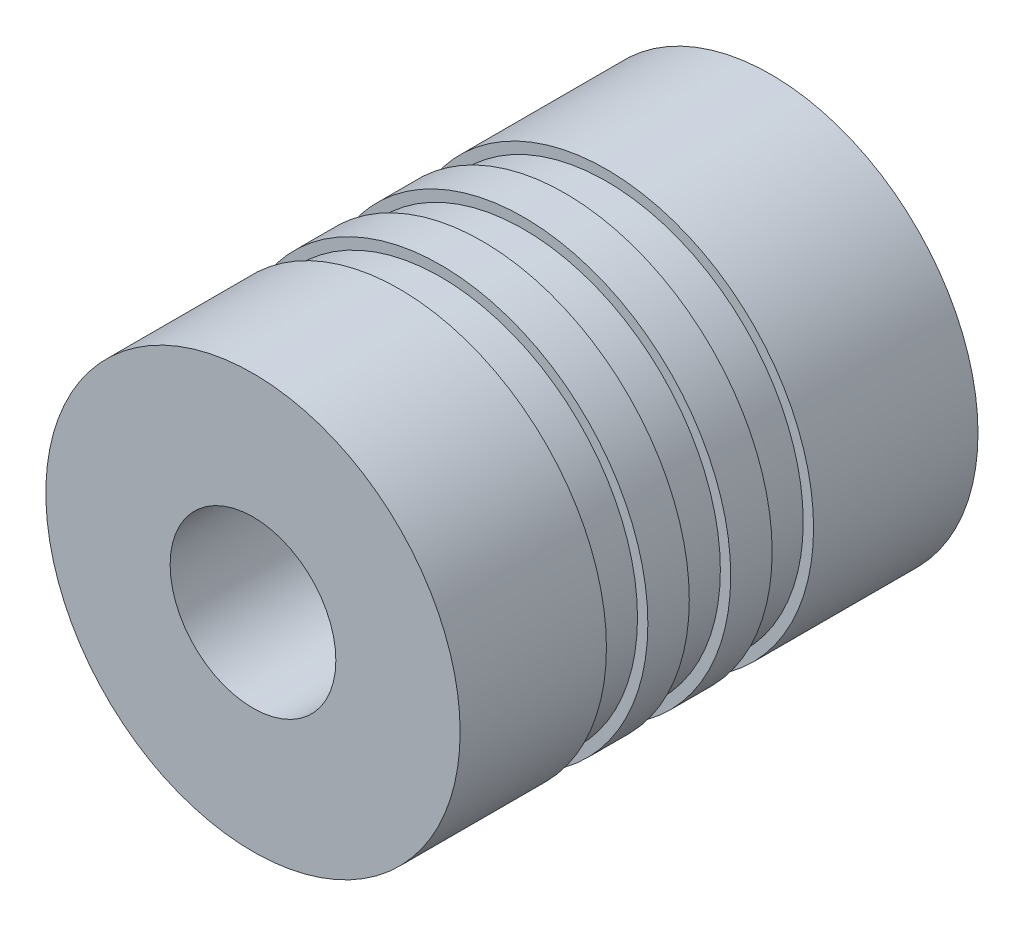
ISO-10303-21;
HEADER;
FILE_DESCRIPTION(('STEP AP214'),'2;1');
FILE_NAME('part.step','',(''),(''),'','','');
FILE_SCHEMA(('AUTOMOTIVE_DESIGN { 1 0 10303 214 1 1 1 1 }'));
ENDSEC;
DATA;
#1=APPLICATION_CONTEXT('core data for automotive mechanical design processes');
#2=APPLICATION_PROTOCOL_DEFINITION('international standard','automotive_design',2000,#1);
#3=PRODUCT_CONTEXT('',#1,'mechanical');
#4=PRODUCT('Part','Part','',(#3));
#5=PRODUCT_RELATED_PRODUCT_CATEGORY('part','',(#4));
#6=PRODUCT_DEFINITION_FORMATION('','',#4);
#7=PRODUCT_DEFINITION_CONTEXT('part definition',#1,'design');
#8=PRODUCT_DEFINITION('design','',#6,#7);
#9=PRODUCT_DEFINITION_SHAPE('','',#8);
#10=(LENGTH_UNIT() NAMED_UNIT(*) SI_UNIT(.MILLI.,.METRE.));
#11=(NAMED_UNIT(*) PLANE_ANGLE_UNIT() SI_UNIT($,.RADIAN.));
#12=(NAMED_UNIT(*) SI_UNIT($,.STERADIAN.) SOLID_ANGLE_UNIT());
#13=UNCERTAINTY_MEASURE_WITH_UNIT(LENGTH_MEASURE(1.E-05),#10,'distance_accuracy_value','');
#14=(GEOMETRIC_REPRESENTATION_CONTEXT(3) GLOBAL_UNCERTAINTY_ASSIGNED_CONTEXT((#13)) GLOBAL_UNIT_ASSIGNED_CONTEXT((#10,
#11,#12)) REPRESENTATION_CONTEXT('',''));
#15=CARTESIAN_POINT('',(0.,0.,0.));
#16=DIRECTION('',(0.,0.,1.));
#17=DIRECTION('',(1.,0.,0.));
#18=AXIS2_PLACEMENT_3D('',#15,#16,#17);
#19=CARTESIAN_POINT('',(0.,0.,15.9375));
#20=DIRECTION('',(0.,0.,1.));
#21=DIRECTION('',(1.,0.,0.));
#22=AXIS2_PLACEMENT_3D('',#19,#20,#21);
#23=PLANE('',#22);
#24=CARTESIAN_POINT('',(0.,0.,15.9375));
#25=DIRECTION('',(0.,0.,1.));
#26=DIRECTION('',(1.,0.,0.));
#27=AXIS2_PLACEMENT_3D('',#24,#25,#26);
#28=CIRCLE('',#27,9.5);
#29=CARTESIAN_POINT('',(9.5,0.,15.9375));
#30=VERTEX_POINT('',#29);
#31=EDGE_CURVE('E69',#30,#30,#28,.T.);
#32=ORIENTED_EDGE('',*,*,#31,.F.);
#33=EDGE_LOOP('',(#32));
#34=FACE_BOUND('',#33,.T.);
#35=CARTESIAN_POINT('',(0.,0.,15.9375));
#36=DIRECTION('',(0.,0.,1.));
#37=DIRECTION('',(1.,0.,0.));
#38=AXIS2_PLACEMENT_3D('',#35,#36,#37);
#39=CIRCLE('',#38,10.);
#40=CARTESIAN_POINT('',(10.,0.,15.9375));
#41=VERTEX_POINT('',#40);
#42=EDGE_CURVE('E17',#41,#41,#39,.F.);
#43=ORIENTED_EDGE('',*,*,#42,.F.);
#44=EDGE_LOOP('',(#43));
#45=FACE_BOUND('',#44,.T.);
#46=ADVANCED_FACE('F14',(#34,#45),#23,.T.);
#47=CARTESIAN_POINT('',(0.,0.,0.));
#48=DIRECTION('',(0.,0.,1.));
#49=DIRECTION('',(1.,0.,0.));
#50=AXIS2_PLACEMENT_3D('',#47,#48,#49);
#51=CYLINDRICAL_SURFACE('',#50,10.);
#52=ORIENTED_EDGE('',*,*,#42,.T.);
#53=EDGE_LOOP('',(#52));
#54=FACE_BOUND('',#53,.T.);
#55=CARTESIAN_POINT('',(0.,0.,13.9375));
#56=DIRECTION('',(0.,0.,1.));
#57=DIRECTION('',(1.,0.,0.));
#58=AXIS2_PLACEMENT_3D('',#55,#56,#57);
#59=CIRCLE('',#58,10.);
#60=CARTESIAN_POINT('',(10.,0.,13.9375));
#61=VERTEX_POINT('',#60);
#62=EDGE_CURVE('E67',#61,#61,#59,.T.);
#63=ORIENTED_EDGE('',*,*,#62,.T.);
#64=EDGE_LOOP('',(#63));
#65=FACE_BOUND('',#64,.T.);
#66=ADVANCED_FACE('F76',(#54,#65),#51,.T.);
#67=CARTESIAN_POINT('',(0.,0.,15.9375));
#68=DIRECTION('',(0.,0.,1.));
#69=DIRECTION('',(1.,0.,0.));
#70=AXIS2_PLACEMENT_3D('',#67,#68,#69);
#71=CYLINDRICAL_SURFACE('',#70,9.5);
#72=ORIENTED_EDGE('',*,*,#31,.T.);
#73=EDGE_LOOP('',(#72));
#74=FACE_BOUND('',#73,.T.);
#75=CARTESIAN_POINT('',(0.,0.,17.9375));
#76=DIRECTION('',(0.,0.,1.));
#77=DIRECTION('',(1.,0.,0.));
#78=AXIS2_PLACEMENT_3D('',#75,#76,#77);
#79=CIRCLE('',#78,9.5);
#80=CARTESIAN_POINT('',(9.5,0.,17.9375));
#81=VERTEX_POINT('',#80);
#82=EDGE_CURVE('E64',#81,#81,#79,.F.);
#83=ORIENTED_EDGE('',*,*,#82,.T.);
#84=EDGE_LOOP('',(#83));
#85=FACE_BOUND('',#84,.T.);
#86=ADVANCED_FACE('F85',(#74,#85),#71,.T.);
#87=CARTESIAN_POINT('',(0.,0.,13.9375));
#88=DIRECTION('',(0.,0.,1.));
#89=DIRECTION('',(1.,0.,0.));
#90=AXIS2_PLACEMENT_3D('',#87,#88,#89);
#91=PLANE('',#90);
#92=CARTESIAN_POINT('',(0.,0.,13.9375));
#93=DIRECTION('',(0.,0.,1.));
#94=DIRECTION('',(1.,0.,0.));
#95=AXIS2_PLACEMENT_3D('',#92,#93,#94);
#96=CIRCLE('',#95,9.5);
#97=CARTESIAN_POINT('',(9.5,0.,13.9375));
#98=VERTEX_POINT('',#97);
#99=EDGE_CURVE('E61',#98,#98,#96,.F.);
#100=ORIENTED_EDGE('',*,*,#99,.F.);
#101=EDGE_LOOP('',(#100));
#102=FACE_BOUND('',#101,.T.);
#103=ORIENTED_EDGE('',*,*,#62,.F.);
#104=EDGE_LOOP('',(#103));
#105=FACE_BOUND('',#104,.T.);
#106=ADVANCED_FACE('F144',(#102,#105),#91,.F.);
#107=CARTESIAN_POINT('',(0.,0.,17.9375));
#108=DIRECTION('',(0.,0.,1.));
#109=DIRECTION('',(1.,0.,0.));
#110=AXIS2_PLACEMENT_3D('',#107,#108,#109);
#111=PLANE('',#110);
#112=ORIENTED_EDGE('',*,*,#82,.F.);
#113=EDGE_LOOP('',(#112));
#114=FACE_BOUND('',#113,.T.);
#115=CARTESIAN_POINT('',(0.,0.,17.9375));
#116=DIRECTION('',(0.,0.,1.));
#117=DIRECTION('',(1.,0.,0.));
#118=AXIS2_PLACEMENT_3D('',#115,#116,#117);
#119=CIRCLE('',#118,10.);
#120=CARTESIAN_POINT('',(10.,0.,17.9375));
#121=VERTEX_POINT('',#120);
#122=EDGE_CURVE('E58',#121,#121,#119,.T.);
#123=ORIENTED_EDGE('',*,*,#122,.F.);
#124=EDGE_LOOP('',(#123));
#125=FACE_BOUND('',#124,.T.);
#126=ADVANCED_FACE('F140',(#114,#125),#111,.F.);
#127=CARTESIAN_POINT('',(0.,0.,11.9375));
#128=DIRECTION('',(0.,0.,1.));
#129=DIRECTION('',(1.,0.,0.));
#130=AXIS2_PLACEMENT_3D('',#127,#128,#129);
#131=CYLINDRICAL_SURFACE('',#130,9.5);
#132=CARTESIAN_POINT('',(0.,0.,11.9375));
#133=DIRECTION('',(0.,0.,1.));
#134=DIRECTION('',(1.,0.,0.));
#135=AXIS2_PLACEMENT_3D('',#132,#133,#134);
#136=CIRCLE('',#135,9.5);
#137=CARTESIAN_POINT('',(9.5,0.,11.9375));
#138=VERTEX_POINT('',#137);
#139=EDGE_CURVE('E55',#138,#138,#136,.F.);
#140=ORIENTED_EDGE('',*,*,#139,.F.);
#141=EDGE_LOOP('',(#140));
#142=FACE_BOUND('',#141,.T.);
#143=ORIENTED_EDGE('',*,*,#99,.T.);
#144=EDGE_LOOP('',(#143));
#145=FACE_BOUND('',#144,.T.);
#146=ADVANCED_FACE('F136',(#142,#145),#131,.T.);
#147=CARTESIAN_POINT('',(0.,0.,0.));
#148=DIRECTION('',(0.,0.,1.));
#149=DIRECTION('',(1.,0.,0.));
#150=AXIS2_PLACEMENT_3D('',#147,#148,#149);
#151=CYLINDRICAL_SURFACE('',#150,10.);
#152=ORIENTED_EDGE('',*,*,#122,.T.);
#153=EDGE_LOOP('',(#152));
#154=FACE_BOUND('',#153,.T.);
#155=CARTESIAN_POINT('',(0.,0.,25.));
#156=DIRECTION('',(0.,0.,1.));
#157=DIRECTION('',(1.,0.,0.));
#158=AXIS2_PLACEMENT_3D('',#155,#156,#157);
#159=CIRCLE('',#158,10.);
#160=CARTESIAN_POINT('',(10.,0.,25.));
#161=VERTEX_POINT('',#160);
#162=EDGE_CURVE('E52',#161,#161,#159,.F.);
#163=ORIENTED_EDGE('',*,*,#162,.T.);
#164=EDGE_LOOP('',(#163));
#165=FACE_BOUND('',#164,.T.);
#166=ADVANCED_FACE('F132',(#154,#165),#151,.T.);
#167=CARTESIAN_POINT('',(0.,0.,11.9375));
#168=DIRECTION('',(0.,0.,1.));
#169=DIRECTION('',(1.,0.,0.));
#170=AXIS2_PLACEMENT_3D('',#167,#168,#169);
#171=PLANE('',#170);
#172=ORIENTED_EDGE('',*,*,#139,.T.);
#173=EDGE_LOOP('',(#172));
#174=FACE_BOUND('',#173,.T.);
#175=CARTESIAN_POINT('',(0.,0.,11.9375));
#176=DIRECTION('',(0.,0.,1.));
#177=DIRECTION('',(1.,0.,0.));
#178=AXIS2_PLACEMENT_3D('',#175,#176,#177);
#179=CIRCLE('',#178,10.);
#180=CARTESIAN_POINT('',(10.,0.,11.9375));
#181=VERTEX_POINT('',#180);
#182=EDGE_CURVE('E49',#181,#181,#179,.F.);
#183=ORIENTED_EDGE('',*,*,#182,.F.);
#184=EDGE_LOOP('',(#183));
#185=FACE_BOUND('',#184,.T.);
#186=ADVANCED_FACE('F128',(#174,#185),#171,.T.);
#187=CARTESIAN_POINT('',(0.,0.,25.));
#188=DIRECTION('',(0.,0.,-1.));
#189=DIRECTION('',(-1.,0.,0.));
#190=AXIS2_PLACEMENT_3D('',#187,#188,#189);
#191=PLANE('',#190);
#192=ORIENTED_EDGE('',*,*,#162,.F.);
#193=EDGE_LOOP('',(#192));
#194=FACE_BOUND('',#193,.T.);
#195=CARTESIAN_POINT('',(0.,0.,25.));
#196=DIRECTION('',(0.,0.,-1.));
#197=DIRECTION('',(-1.,0.,0.));
#198=AXIS2_PLACEMENT_3D('',#195,#196,#197);
#199=CIRCLE('',#198,4.);
#200=CARTESIAN_POINT('',(-4.,0.,25.));
#201=VERTEX_POINT('',#200);
#202=EDGE_CURVE('E46',#201,#201,#199,.T.);
#203=ORIENTED_EDGE('',*,*,#202,.T.);
#204=EDGE_LOOP('',(#203));
#205=FACE_BOUND('',#204,.T.);
#206=ADVANCED_FACE('F124',(#194,#205),#191,.F.);
#207=CARTESIAN_POINT('',(0.,0.,0.));
#208=DIRECTION('',(0.,0.,1.));
#209=DIRECTION('',(1.,0.,0.));
#210=AXIS2_PLACEMENT_3D('',#207,#208,#209);
#211=CYLINDRICAL_SURFACE('',#210,10.);
#212=CARTESIAN_POINT('',(0.,0.,9.9375));
#213=DIRECTION('',(0.,0.,1.));
#214=DIRECTION('',(1.,0.,0.));
#215=AXIS2_PLACEMENT_3D('',#212,#213,#214);
#216=CIRCLE('',#215,10.);
#217=CARTESIAN_POINT('',(10.,0.,9.9375));
#218=VERTEX_POINT('',#217);
#219=EDGE_CURVE('E43',#218,#218,#216,.T.);
#220=ORIENTED_EDGE('',*,*,#219,.T.);
#221=EDGE_LOOP('',(#220));
#222=FACE_BOUND('',#221,.T.);
#223=ORIENTED_EDGE('',*,*,#182,.T.);
#224=EDGE_LOOP('',(#223));
#225=FACE_BOUND('',#224,.T.);
#226=ADVANCED_FACE('F120',(#222,#225),#211,.T.);
#227=CARTESIAN_POINT('',(0.,0.,25.));
#228=DIRECTION('',(0.,0.,-1.));
#229=DIRECTION('',(-1.,0.,0.));
#230=AXIS2_PLACEMENT_3D('',#227,#228,#229);
#231=CYLINDRICAL_SURFACE('',#230,4.);
#232=ORIENTED_EDGE('',*,*,#202,.F.);
#233=EDGE_LOOP('',(#232));
#234=FACE_BOUND('',#233,.T.);
#235=CARTESIAN_POINT('',(0.,0.,15.475));
#236=DIRECTION('',(0.,0.,-1.));
#237=DIRECTION('',(-1.,0.,0.));
#238=AXIS2_PLACEMENT_3D('',#235,#236,#237);
#239=CIRCLE('',#238,4.);
#240=CARTESIAN_POINT('',(-4.,0.,15.475));
#241=VERTEX_POINT('',#240);
#242=EDGE_CURVE('E40',#241,#241,#239,.T.);
#243=ORIENTED_EDGE('',*,*,#242,.T.);
#244=EDGE_LOOP('',(#243));
#245=FACE_BOUND('',#244,.T.);
#246=ADVANCED_FACE('F116',(#234,#245),#231,.F.);
#247=CARTESIAN_POINT('',(0.,0.,9.9375));
#248=DIRECTION('',(0.,0.,1.));
#249=DIRECTION('',(1.,0.,0.));
#250=AXIS2_PLACEMENT_3D('',#247,#248,#249);
#251=PLANE('',#250);
#252=CARTESIAN_POINT('',(0.,0.,9.9375));
#253=DIRECTION('',(0.,0.,1.));
#254=DIRECTION('',(1.,0.,0.));
#255=AXIS2_PLACEMENT_3D('',#252,#253,#254);
#256=CIRCLE('',#255,9.5);
#257=CARTESIAN_POINT('',(9.5,0.,9.9375));
#258=VERTEX_POINT('',#257);
#259=EDGE_CURVE('E37',#258,#258,#256,.F.);
#260=ORIENTED_EDGE('',*,*,#259,.F.);
#261=EDGE_LOOP('',(#260));
#262=FACE_BOUND('',#261,.T.);
#263=ORIENTED_EDGE('',*,*,#219,.F.);
#264=EDGE_LOOP('',(#263));
#265=FACE_BOUND('',#264,.T.);
#266=ADVANCED_FACE('F112',(#262,#265),#251,.F.);
#267=CARTESIAN_POINT('',(0.,0.,15.475));
#268=DIRECTION('',(0.,0.,-1.));
#269=DIRECTION('',(-1.,0.,0.));
#270=AXIS2_PLACEMENT_3D('',#267,#268,#269);
#271=PLANE('',#270);
#272=ORIENTED_EDGE('',*,*,#242,.F.);
#273=EDGE_LOOP('',(#272));
#274=FACE_BOUND('',#273,.T.);
#275=CARTESIAN_POINT('',(0.,0.,15.475));
#276=DIRECTION('',(0.,0.,1.));
#277=DIRECTION('',(1.,0.,0.));
#278=AXIS2_PLACEMENT_3D('',#275,#276,#277);
#279=CIRCLE('',#278,2.5);
#280=CARTESIAN_POINT('',(2.5,0.,15.475));
#281=VERTEX_POINT('',#280);
#282=EDGE_CURVE('E34',#281,#281,#279,.F.);
#283=ORIENTED_EDGE('',*,*,#282,.T.);
#284=EDGE_LOOP('',(#283));
#285=FACE_BOUND('',#284,.T.);
#286=ADVANCED_FACE('F108',(#274,#285),#271,.F.);
#287=CARTESIAN_POINT('',(0.,0.,7.9375));
#288=DIRECTION('',(0.,0.,1.));
#289=DIRECTION('',(1.,0.,0.));
#290=AXIS2_PLACEMENT_3D('',#287,#288,#289);
#291=CYLINDRICAL_SURFACE('',#290,9.5);
#292=CARTESIAN_POINT('',(0.,0.,7.9375));
#293=DIRECTION('',(0.,0.,1.));
#294=DIRECTION('',(1.,0.,0.));
#295=AXIS2_PLACEMENT_3D('',#292,#293,#294);
#296=CIRCLE('',#295,9.5);
#297=CARTESIAN_POINT('',(9.5,0.,7.9375));
#298=VERTEX_POINT('',#297);
#299=EDGE_CURVE('E31',#298,#298,#296,.F.);
#300=ORIENTED_EDGE('',*,*,#299,.F.);
#301=EDGE_LOOP('',(#300));
#302=FACE_BOUND('',#301,.T.);
#303=ORIENTED_EDGE('',*,*,#259,.T.);
#304=EDGE_LOOP('',(#303));
#305=FACE_BOUND('',#304,.T.);
#306=ADVANCED_FACE('F104',(#302,#305),#291,.T.);
#307=CARTESIAN_POINT('',(0.,0.,0.));
#308=DIRECTION('',(0.,0.,1.));
#309=DIRECTION('',(1.,0.,0.));
#310=AXIS2_PLACEMENT_3D('',#307,#308,#309);
#311=CYLINDRICAL_SURFACE('',#310,2.5);
#312=CARTESIAN_POINT('',(0.,0.,0.));
#313=DIRECTION('',(0.,0.,1.));
#314=DIRECTION('',(1.,0.,0.));
#315=AXIS2_PLACEMENT_3D('',#312,#313,#314);
#316=CIRCLE('',#315,2.5);
#317=CARTESIAN_POINT('',(2.5,0.,0.));
#318=VERTEX_POINT('',#317);
#319=EDGE_CURVE('E26',#318,#318,#316,.T.);
#320=ORIENTED_EDGE('',*,*,#319,.F.);
#321=EDGE_LOOP('',(#320));
#322=FACE_BOUND('',#321,.T.);
#323=ORIENTED_EDGE('',*,*,#282,.F.);
#324=EDGE_LOOP('',(#323));
#325=FACE_BOUND('',#324,.T.);
#326=ADVANCED_FACE('F100',(#322,#325),#311,.F.);
#327=CARTESIAN_POINT('',(0.,0.,7.9375));
#328=DIRECTION('',(0.,0.,1.));
#329=DIRECTION('',(1.,0.,0.));
#330=AXIS2_PLACEMENT_3D('',#327,#328,#329);
#331=PLANE('',#330);
#332=ORIENTED_EDGE('',*,*,#299,.T.);
#333=EDGE_LOOP('',(#332));
#334=FACE_BOUND('',#333,.T.);
#335=CARTESIAN_POINT('',(0.,0.,7.9375));
#336=DIRECTION('',(0.,0.,1.));
#337=DIRECTION('',(1.,0.,0.));
#338=AXIS2_PLACEMENT_3D('',#335,#336,#337);
#339=CIRCLE('',#338,10.);
#340=CARTESIAN_POINT('',(10.,0.,7.9375));
#341=VERTEX_POINT('',#340);
#342=EDGE_CURVE('E21',#341,#341,#339,.F.);
#343=ORIENTED_EDGE('',*,*,#342,.F.);
#344=EDGE_LOOP('',(#343));
#345=FACE_BOUND('',#344,.T.);
#346=ADVANCED_FACE('F93',(#334,#345),#331,.T.);
#347=CARTESIAN_POINT('',(0.,0.,0.));
#348=DIRECTION('',(0.,0.,-1.));
#349=DIRECTION('',(-1.,0.,0.));
#350=AXIS2_PLACEMENT_3D('',#347,#348,#349);
#351=PLANE('',#350);
#352=CARTESIAN_POINT('',(0.,0.,0.));
#353=DIRECTION('',(0.,0.,1.));
#354=DIRECTION('',(1.,0.,0.));
#355=AXIS2_PLACEMENT_3D('',#352,#353,#354);
#356=CIRCLE('',#355,10.);
#357=CARTESIAN_POINT('',(10.,0.,0.));
#358=VERTEX_POINT('',#357);
#359=EDGE_CURVE('E10',#358,#358,#356,.T.);
#360=ORIENTED_EDGE('',*,*,#359,.F.);
#361=EDGE_LOOP('',(#360));
#362=FACE_BOUND('',#361,.T.);
#363=ORIENTED_EDGE('',*,*,#319,.T.);
#364=EDGE_LOOP('',(#363));
#365=FACE_BOUND('',#364,.T.);
#366=ADVANCED_FACE('F88',(#362,#365),#351,.T.);
#367=CARTESIAN_POINT('',(0.,0.,0.));
#368=DIRECTION('',(0.,0.,1.));
#369=DIRECTION('',(1.,0.,0.));
#370=AXIS2_PLACEMENT_3D('',#367,#368,#369);
#371=CYLINDRICAL_SURFACE('',#370,10.);
#372=ORIENTED_EDGE('',*,*,#359,.T.);
#373=EDGE_LOOP('',(#372));
#374=FACE_BOUND('',#373,.T.);
#375=ORIENTED_EDGE('',*,*,#342,.T.);
#376=EDGE_LOOP('',(#375));
#377=FACE_BOUND('',#376,.T.);
#378=ADVANCED_FACE('F86',(#374,#377),#371,.T.);
#379=CLOSED_SHELL('',(#46,#66,#86,#106,#126,#146,#166,#186,#206,#226,#246,#266,#286,#306,#326,
#346,#366,#378));
#380=MANIFOLD_SOLID_BREP('B1',#379);
#381=ADVANCED_BREP_SHAPE_REPRESENTATION('',(#18,#380),#14);
#382=SHAPE_DEFINITION_REPRESENTATION(#9,#381);
ENDSEC;
END-ISO-10303-21;
